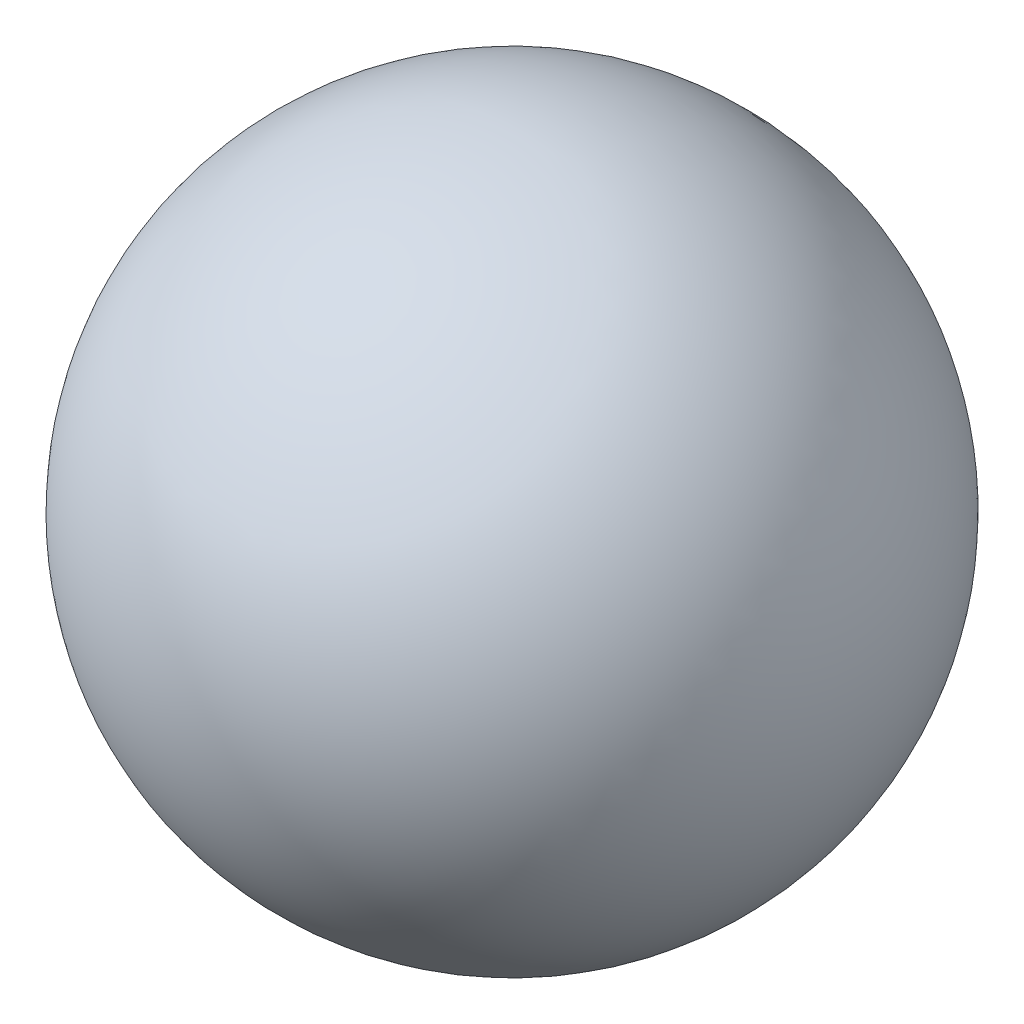
ISO-10303-21;
HEADER;
FILE_DESCRIPTION(('STEP AP214'),'2;1');
FILE_NAME('part.step','',(''),(''),'','','');
FILE_SCHEMA(('AUTOMOTIVE_DESIGN { 1 0 10303 214 1 1 1 1 }'));
ENDSEC;
DATA;
#1=APPLICATION_CONTEXT('core data for automotive mechanical design processes');
#2=APPLICATION_PROTOCOL_DEFINITION('international standard','automotive_design',2000,#1);
#3=PRODUCT_CONTEXT('',#1,'mechanical');
#4=PRODUCT('Part','Part','',(#3));
#5=PRODUCT_RELATED_PRODUCT_CATEGORY('part','',(#4));
#6=PRODUCT_DEFINITION_FORMATION('','',#4);
#7=PRODUCT_DEFINITION_CONTEXT('part definition',#1,'design');
#8=PRODUCT_DEFINITION('design','',#6,#7);
#9=PRODUCT_DEFINITION_SHAPE('','',#8);
#10=(LENGTH_UNIT() NAMED_UNIT(*) SI_UNIT(.MILLI.,.METRE.));
#11=(NAMED_UNIT(*) PLANE_ANGLE_UNIT() SI_UNIT($,.RADIAN.));
#12=(NAMED_UNIT(*) SI_UNIT($,.STERADIAN.) SOLID_ANGLE_UNIT());
#13=UNCERTAINTY_MEASURE_WITH_UNIT(LENGTH_MEASURE(1.E-05),#10,'distance_accuracy_value','');
#14=(GEOMETRIC_REPRESENTATION_CONTEXT(3) GLOBAL_UNCERTAINTY_ASSIGNED_CONTEXT((#13)) GLOBAL_UNIT_ASSIGNED_CONTEXT((#10,
#11,#12)) REPRESENTATION_CONTEXT('',''));
#15=CARTESIAN_POINT('',(0.,0.,0.));
#16=DIRECTION('',(0.,0.,1.));
#17=DIRECTION('',(1.,0.,0.));
#18=AXIS2_PLACEMENT_3D('',#15,#16,#17);
#19=CARTESIAN_POINT('',(49.75,-13.853198318547,-51.1569730984644));
#20=DIRECTION('',(0.,-0.261383566232645,-0.965235013508889));
#21=DIRECTION('',(0.173648177666933,0.950570924782397,-0.257412562535889));
#22=AXIS2_PLACEMENT_3D('',#19,#20,#21);
#23=SPHERICAL_SURFACE('',#22,5.95);
#24=CARTESIAN_POINT('',(49.75,-15.4084305376312,-56.9001214288423));
#25=VERTEX_POINT('',#24);
#26=VERTEX_LOOP('',#25);
#27=FACE_BOUND('',#26,.T.);
#28=CARTESIAN_POINT('',(49.75,-12.2979660994628,-45.4138247680865));
#29=VERTEX_POINT('',#28);
#30=VERTEX_LOOP('',#29);
#31=FACE_BOUND('',#30,.T.);
#32=ADVANCED_FACE('F16',(#27,#31),#23,.T.);
#33=CLOSED_SHELL('',(#32));
#34=MANIFOLD_SOLID_BREP('B1',#33);
#35=ADVANCED_BREP_SHAPE_REPRESENTATION('',(#18,#34),#14);
#36=SHAPE_DEFINITION_REPRESENTATION(#9,#35);
ENDSEC;
END-ISO-10303-21;
